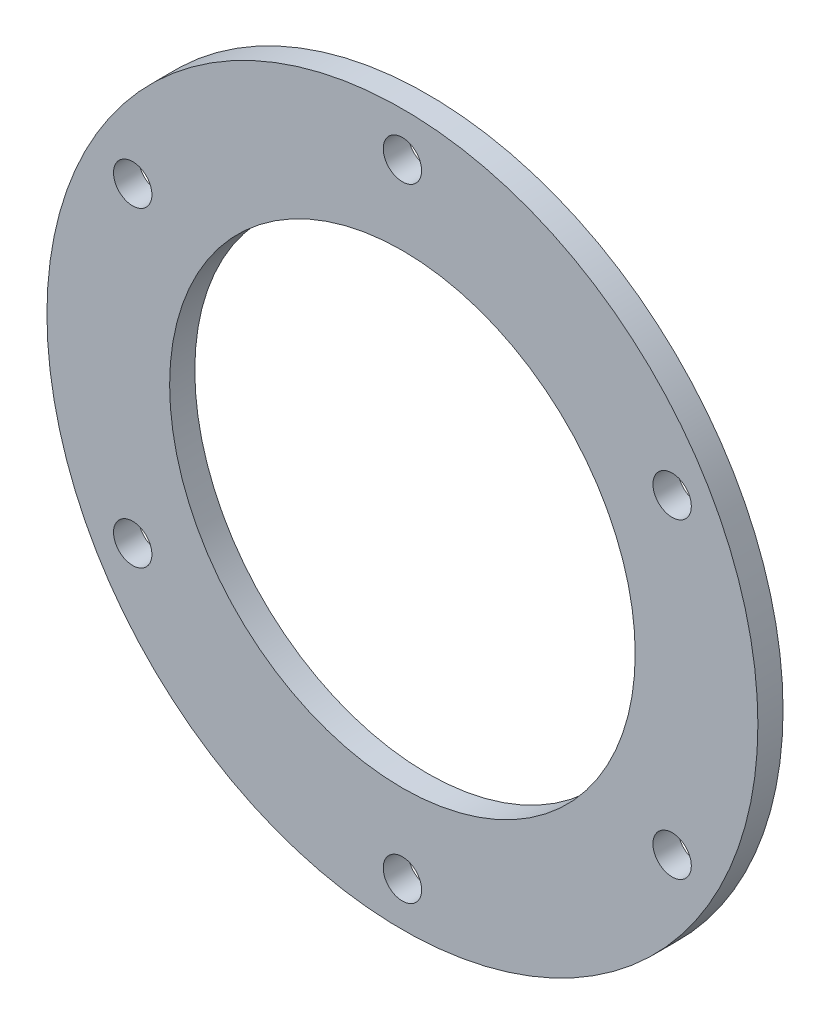
ISO-10303-21;
HEADER;
FILE_DESCRIPTION(('STEP AP214'),'2;1');
FILE_NAME('part.step','',(''),(''),'','','');
FILE_SCHEMA(('AUTOMOTIVE_DESIGN { 1 0 10303 214 1 1 1 1 }'));
ENDSEC;
DATA;
#1=APPLICATION_CONTEXT('core data for automotive mechanical design processes');
#2=APPLICATION_PROTOCOL_DEFINITION('international standard','automotive_design',2000,#1);
#3=PRODUCT_CONTEXT('',#1,'mechanical');
#4=PRODUCT('Part','Part','',(#3));
#5=PRODUCT_RELATED_PRODUCT_CATEGORY('part','',(#4));
#6=PRODUCT_DEFINITION_FORMATION('','',#4);
#7=PRODUCT_DEFINITION_CONTEXT('part definition',#1,'design');
#8=PRODUCT_DEFINITION('design','',#6,#7);
#9=PRODUCT_DEFINITION_SHAPE('','',#8);
#10=(LENGTH_UNIT() NAMED_UNIT(*) SI_UNIT(.MILLI.,.METRE.));
#11=(NAMED_UNIT(*) PLANE_ANGLE_UNIT() SI_UNIT($,.RADIAN.));
#12=(NAMED_UNIT(*) SI_UNIT($,.STERADIAN.) SOLID_ANGLE_UNIT());
#13=UNCERTAINTY_MEASURE_WITH_UNIT(LENGTH_MEASURE(1.E-05),#10,'distance_accuracy_value','');
#14=(GEOMETRIC_REPRESENTATION_CONTEXT(3) GLOBAL_UNCERTAINTY_ASSIGNED_CONTEXT((#13)) GLOBAL_UNIT_ASSIGNED_CONTEXT((#10,
#11,#12)) REPRESENTATION_CONTEXT('',''));
#15=CARTESIAN_POINT('',(0.,0.,0.));
#16=DIRECTION('',(0.,0.,1.));
#17=DIRECTION('',(1.,0.,0.));
#18=AXIS2_PLACEMENT_3D('',#15,#16,#17);
#19=CARTESIAN_POINT('',(0.,0.,2.));
#20=DIRECTION('',(0.,0.,1.));
#21=DIRECTION('',(1.,0.,0.));
#22=AXIS2_PLACEMENT_3D('',#19,#20,#21);
#23=PLANE('',#22);
#24=CARTESIAN_POINT('',(0.,24.75,2.));
#25=DIRECTION('',(0.,0.,1.));
#26=DIRECTION('',(1.,0.,0.));
#27=AXIS2_PLACEMENT_3D('',#24,#25,#26);
#28=CIRCLE('',#27,1.525);
#29=CARTESIAN_POINT('',(1.525,24.75,2.));
#30=VERTEX_POINT('',#29);
#31=EDGE_CURVE('E77',#30,#30,#28,.T.);
#32=ORIENTED_EDGE('',*,*,#31,.F.);
#33=EDGE_LOOP('',(#32));
#34=FACE_BOUND('',#33,.T.);
#35=CARTESIAN_POINT('',(-21.4341287436649,12.375,2.));
#36=DIRECTION('',(0.,0.,1.));
#37=DIRECTION('',(1.,0.,0.));
#38=AXIS2_PLACEMENT_3D('',#35,#36,#37);
#39=CIRCLE('',#38,1.525);
#40=CARTESIAN_POINT('',(-19.9091287436649,12.375,2.));
#41=VERTEX_POINT('',#40);
#42=EDGE_CURVE('E78',#41,#41,#39,.T.);
#43=ORIENTED_EDGE('',*,*,#42,.F.);
#44=EDGE_LOOP('',(#43));
#45=FACE_BOUND('',#44,.T.);
#46=CARTESIAN_POINT('',(-21.4341287436649,-12.375,2.));
#47=DIRECTION('',(0.,0.,1.));
#48=DIRECTION('',(1.,0.,0.));
#49=AXIS2_PLACEMENT_3D('',#46,#47,#48);
#50=CIRCLE('',#49,1.525);
#51=CARTESIAN_POINT('',(-19.9091287436649,-12.375,2.));
#52=VERTEX_POINT('',#51);
#53=EDGE_CURVE('E52',#52,#52,#50,.T.);
#54=ORIENTED_EDGE('',*,*,#53,.F.);
#55=EDGE_LOOP('',(#54));
#56=FACE_BOUND('',#55,.T.);
#57=CARTESIAN_POINT('',(0.,-24.75,2.));
#58=DIRECTION('',(0.,0.,1.));
#59=DIRECTION('',(1.,0.,0.));
#60=AXIS2_PLACEMENT_3D('',#57,#58,#59);
#61=CIRCLE('',#60,1.525);
#62=CARTESIAN_POINT('',(1.525,-24.75,2.));
#63=VERTEX_POINT('',#62);
#64=EDGE_CURVE('E59',#63,#63,#61,.T.);
#65=ORIENTED_EDGE('',*,*,#64,.F.);
#66=EDGE_LOOP('',(#65));
#67=FACE_BOUND('',#66,.T.);
#68=CARTESIAN_POINT('',(21.4341287436649,-12.375,2.));
#69=DIRECTION('',(0.,0.,1.));
#70=DIRECTION('',(1.,0.,0.));
#71=AXIS2_PLACEMENT_3D('',#68,#69,#70);
#72=CIRCLE('',#71,1.525);
#73=CARTESIAN_POINT('',(22.9591287436649,-12.375,2.));
#74=VERTEX_POINT('',#73);
#75=EDGE_CURVE('E65',#74,#74,#72,.T.);
#76=ORIENTED_EDGE('',*,*,#75,.F.);
#77=EDGE_LOOP('',(#76));
#78=FACE_BOUND('',#77,.T.);
#79=CARTESIAN_POINT('',(21.4341287436649,12.375,2.));
#80=DIRECTION('',(0.,0.,1.));
#81=DIRECTION('',(1.,0.,0.));
#82=AXIS2_PLACEMENT_3D('',#79,#80,#81);
#83=CIRCLE('',#82,1.525);
#84=CARTESIAN_POINT('',(22.9591287436649,12.375,2.));
#85=VERTEX_POINT('',#84);
#86=EDGE_CURVE('E71',#85,#85,#83,.T.);
#87=ORIENTED_EDGE('',*,*,#86,.F.);
#88=EDGE_LOOP('',(#87));
#89=FACE_BOUND('',#88,.T.);
#90=CARTESIAN_POINT('',(0.,0.,2.));
#91=DIRECTION('',(0.,0.,1.));
#92=DIRECTION('',(1.,0.,0.));
#93=AXIS2_PLACEMENT_3D('',#90,#91,#92);
#94=CIRCLE('',#93,28.25);
#95=CARTESIAN_POINT('',(28.25,0.,2.));
#96=VERTEX_POINT('',#95);
#97=EDGE_CURVE('E10',#96,#96,#94,.T.);
#98=ORIENTED_EDGE('',*,*,#97,.T.);
#99=EDGE_LOOP('',(#98));
#100=FACE_BOUND('',#99,.T.);
#101=CARTESIAN_POINT('',(0.,0.,2.));
#102=DIRECTION('',(0.,0.,1.));
#103=DIRECTION('',(1.,0.,0.));
#104=AXIS2_PLACEMENT_3D('',#101,#102,#103);
#105=CIRCLE('',#104,18.5);
#106=CARTESIAN_POINT('',(18.5,0.,2.));
#107=VERTEX_POINT('',#106);
#108=EDGE_CURVE('E44',#107,#107,#105,.T.);
#109=ORIENTED_EDGE('',*,*,#108,.F.);
#110=EDGE_LOOP('',(#109));
#111=FACE_BOUND('',#110,.T.);
#112=ADVANCED_FACE('F33',(#34,#45,#56,#67,#78,#89,#100,#111),#23,.T.);
#113=CARTESIAN_POINT('',(0.,0.,0.));
#114=DIRECTION('',(0.,0.,1.));
#115=DIRECTION('',(1.,0.,0.));
#116=AXIS2_PLACEMENT_3D('',#113,#114,#115);
#117=PLANE('',#116);
#118=CARTESIAN_POINT('',(0.,24.75,0.));
#119=DIRECTION('',(0.,0.,1.));
#120=DIRECTION('',(1.,0.,0.));
#121=AXIS2_PLACEMENT_3D('',#118,#119,#120);
#122=CIRCLE('',#121,1.525);
#123=CARTESIAN_POINT('',(1.525,24.75,0.));
#124=VERTEX_POINT('',#123);
#125=EDGE_CURVE('E49',#124,#124,#122,.T.);
#126=ORIENTED_EDGE('',*,*,#125,.T.);
#127=EDGE_LOOP('',(#126));
#128=FACE_BOUND('',#127,.T.);
#129=CARTESIAN_POINT('',(-21.4341287436649,12.375,0.));
#130=DIRECTION('',(0.,0.,1.));
#131=DIRECTION('',(1.,0.,0.));
#132=AXIS2_PLACEMENT_3D('',#129,#130,#131);
#133=CIRCLE('',#132,1.525);
#134=CARTESIAN_POINT('',(-19.9091287436649,12.375,0.));
#135=VERTEX_POINT('',#134);
#136=EDGE_CURVE('E56',#135,#135,#133,.T.);
#137=ORIENTED_EDGE('',*,*,#136,.T.);
#138=EDGE_LOOP('',(#137));
#139=FACE_BOUND('',#138,.T.);
#140=CARTESIAN_POINT('',(-21.4341287436649,-12.375,0.));
#141=DIRECTION('',(0.,0.,1.));
#142=DIRECTION('',(1.,0.,0.));
#143=AXIS2_PLACEMENT_3D('',#140,#141,#142);
#144=CIRCLE('',#143,1.525);
#145=CARTESIAN_POINT('',(-19.9091287436649,-12.375,0.));
#146=VERTEX_POINT('',#145);
#147=EDGE_CURVE('E55',#146,#146,#144,.T.);
#148=ORIENTED_EDGE('',*,*,#147,.T.);
#149=EDGE_LOOP('',(#148));
#150=FACE_BOUND('',#149,.T.);
#151=CARTESIAN_POINT('',(0.,-24.75,0.));
#152=DIRECTION('',(0.,0.,1.));
#153=DIRECTION('',(1.,0.,0.));
#154=AXIS2_PLACEMENT_3D('',#151,#152,#153);
#155=CIRCLE('',#154,1.525);
#156=CARTESIAN_POINT('',(1.525,-24.75,0.));
#157=VERTEX_POINT('',#156);
#158=EDGE_CURVE('E62',#157,#157,#155,.T.);
#159=ORIENTED_EDGE('',*,*,#158,.T.);
#160=EDGE_LOOP('',(#159));
#161=FACE_BOUND('',#160,.T.);
#162=CARTESIAN_POINT('',(21.4341287436649,-12.375,0.));
#163=DIRECTION('',(0.,0.,1.));
#164=DIRECTION('',(1.,0.,0.));
#165=AXIS2_PLACEMENT_3D('',#162,#163,#164);
#166=CIRCLE('',#165,1.525);
#167=CARTESIAN_POINT('',(22.9591287436649,-12.375,0.));
#168=VERTEX_POINT('',#167);
#169=EDGE_CURVE('E68',#168,#168,#166,.T.);
#170=ORIENTED_EDGE('',*,*,#169,.T.);
#171=EDGE_LOOP('',(#170));
#172=FACE_BOUND('',#171,.T.);
#173=CARTESIAN_POINT('',(21.4341287436649,12.375,0.));
#174=DIRECTION('',(0.,0.,1.));
#175=DIRECTION('',(1.,0.,0.));
#176=AXIS2_PLACEMENT_3D('',#173,#174,#175);
#177=CIRCLE('',#176,1.525);
#178=CARTESIAN_POINT('',(22.9591287436649,12.375,0.));
#179=VERTEX_POINT('',#178);
#180=EDGE_CURVE('E74',#179,#179,#177,.T.);
#181=ORIENTED_EDGE('',*,*,#180,.T.);
#182=EDGE_LOOP('',(#181));
#183=FACE_BOUND('',#182,.T.);
#184=CARTESIAN_POINT('',(0.,0.,0.));
#185=DIRECTION('',(0.,0.,1.));
#186=DIRECTION('',(1.,0.,0.));
#187=AXIS2_PLACEMENT_3D('',#184,#185,#186);
#188=CIRCLE('',#187,28.25);
#189=CARTESIAN_POINT('',(28.25,0.,0.));
#190=VERTEX_POINT('',#189);
#191=EDGE_CURVE('E37',#190,#190,#188,.T.);
#192=ORIENTED_EDGE('',*,*,#191,.F.);
#193=EDGE_LOOP('',(#192));
#194=FACE_BOUND('',#193,.T.);
#195=CARTESIAN_POINT('',(0.,0.,0.));
#196=DIRECTION('',(0.,0.,1.));
#197=DIRECTION('',(1.,0.,0.));
#198=AXIS2_PLACEMENT_3D('',#195,#196,#197);
#199=CIRCLE('',#198,18.5);
#200=CARTESIAN_POINT('',(18.5,0.,0.));
#201=VERTEX_POINT('',#200);
#202=EDGE_CURVE('E46',#201,#201,#199,.T.);
#203=ORIENTED_EDGE('',*,*,#202,.T.);
#204=EDGE_LOOP('',(#203));
#205=FACE_BOUND('',#204,.T.);
#206=ADVANCED_FACE('F88',(#128,#139,#150,#161,#172,#183,#194,#205),#117,.F.);
#207=CARTESIAN_POINT('',(0.,0.,2.));
#208=DIRECTION('',(0.,0.,-1.));
#209=DIRECTION('',(-1.,0.,0.));
#210=AXIS2_PLACEMENT_3D('',#207,#208,#209);
#211=CYLINDRICAL_SURFACE('',#210,28.25);
#212=ORIENTED_EDGE('',*,*,#97,.F.);
#213=EDGE_LOOP('',(#212));
#214=FACE_BOUND('',#213,.T.);
#215=ORIENTED_EDGE('',*,*,#191,.T.);
#216=EDGE_LOOP('',(#215));
#217=FACE_BOUND('',#216,.T.);
#218=ADVANCED_FACE('F35',(#214,#217),#211,.T.);
#219=CARTESIAN_POINT('',(0.,0.,2.));
#220=DIRECTION('',(0.,0.,-1.));
#221=DIRECTION('',(-1.,0.,0.));
#222=AXIS2_PLACEMENT_3D('',#219,#220,#221);
#223=CYLINDRICAL_SURFACE('',#222,18.5);
#224=ORIENTED_EDGE('',*,*,#108,.T.);
#225=EDGE_LOOP('',(#224));
#226=FACE_BOUND('',#225,.T.);
#227=ORIENTED_EDGE('',*,*,#202,.F.);
#228=EDGE_LOOP('',(#227));
#229=FACE_BOUND('',#228,.T.);
#230=ADVANCED_FACE('F113',(#226,#229),#223,.F.);
#231=CARTESIAN_POINT('',(21.4341287436649,12.375,0.));
#232=DIRECTION('',(0.,0.,1.));
#233=DIRECTION('',(1.,0.,0.));
#234=AXIS2_PLACEMENT_3D('',#231,#232,#233);
#235=CYLINDRICAL_SURFACE('',#234,1.525);
#236=ORIENTED_EDGE('',*,*,#180,.F.);
#237=EDGE_LOOP('',(#236));
#238=FACE_BOUND('',#237,.T.);
#239=ORIENTED_EDGE('',*,*,#86,.T.);
#240=EDGE_LOOP('',(#239));
#241=FACE_BOUND('',#240,.T.);
#242=ADVANCED_FACE('F116',(#238,#241),#235,.F.);
#243=CARTESIAN_POINT('',(21.4341287436649,-12.375,0.));
#244=DIRECTION('',(0.,0.,1.));
#245=DIRECTION('',(1.,0.,0.));
#246=AXIS2_PLACEMENT_3D('',#243,#244,#245);
#247=CYLINDRICAL_SURFACE('',#246,1.525);
#248=ORIENTED_EDGE('',*,*,#169,.F.);
#249=EDGE_LOOP('',(#248));
#250=FACE_BOUND('',#249,.T.);
#251=ORIENTED_EDGE('',*,*,#75,.T.);
#252=EDGE_LOOP('',(#251));
#253=FACE_BOUND('',#252,.T.);
#254=ADVANCED_FACE('F133',(#250,#253),#247,.F.);
#255=CARTESIAN_POINT('',(0.,-24.75,0.));
#256=DIRECTION('',(0.,0.,1.));
#257=DIRECTION('',(1.,0.,0.));
#258=AXIS2_PLACEMENT_3D('',#255,#256,#257);
#259=CYLINDRICAL_SURFACE('',#258,1.525);
#260=ORIENTED_EDGE('',*,*,#158,.F.);
#261=EDGE_LOOP('',(#260));
#262=FACE_BOUND('',#261,.T.);
#263=ORIENTED_EDGE('',*,*,#64,.T.);
#264=EDGE_LOOP('',(#263));
#265=FACE_BOUND('',#264,.T.);
#266=ADVANCED_FACE('F129',(#262,#265),#259,.F.);
#267=CARTESIAN_POINT('',(-21.4341287436649,-12.375,0.));
#268=DIRECTION('',(0.,0.,1.));
#269=DIRECTION('',(1.,0.,0.));
#270=AXIS2_PLACEMENT_3D('',#267,#268,#269);
#271=CYLINDRICAL_SURFACE('',#270,1.525);
#272=ORIENTED_EDGE('',*,*,#147,.F.);
#273=EDGE_LOOP('',(#272));
#274=FACE_BOUND('',#273,.T.);
#275=ORIENTED_EDGE('',*,*,#53,.T.);
#276=EDGE_LOOP('',(#275));
#277=FACE_BOUND('',#276,.T.);
#278=ADVANCED_FACE('F126',(#274,#277),#271,.F.);
#279=CARTESIAN_POINT('',(-21.4341287436649,12.375,0.));
#280=DIRECTION('',(0.,0.,1.));
#281=DIRECTION('',(1.,0.,0.));
#282=AXIS2_PLACEMENT_3D('',#279,#280,#281);
#283=CYLINDRICAL_SURFACE('',#282,1.525);
#284=ORIENTED_EDGE('',*,*,#136,.F.);
#285=EDGE_LOOP('',(#284));
#286=FACE_BOUND('',#285,.T.);
#287=ORIENTED_EDGE('',*,*,#42,.T.);
#288=EDGE_LOOP('',(#287));
#289=FACE_BOUND('',#288,.T.);
#290=ADVANCED_FACE('F94',(#286,#289),#283,.F.);
#291=CARTESIAN_POINT('',(0.,24.75,0.));
#292=DIRECTION('',(0.,0.,1.));
#293=DIRECTION('',(1.,0.,0.));
#294=AXIS2_PLACEMENT_3D('',#291,#292,#293);
#295=CYLINDRICAL_SURFACE('',#294,1.525);
#296=ORIENTED_EDGE('',*,*,#125,.F.);
#297=EDGE_LOOP('',(#296));
#298=FACE_BOUND('',#297,.T.);
#299=ORIENTED_EDGE('',*,*,#31,.T.);
#300=EDGE_LOOP('',(#299));
#301=FACE_BOUND('',#300,.T.);
#302=ADVANCED_FACE('F91',(#298,#301),#295,.F.);
#303=CLOSED_SHELL('',(#112,#206,#218,#230,#242,#254,#266,#278,#290,#302));
#304=MANIFOLD_SOLID_BREP('B2',#303);
#305=ADVANCED_BREP_SHAPE_REPRESENTATION('',(#18,#304),#14);
#306=SHAPE_DEFINITION_REPRESENTATION(#9,#305);
ENDSEC;
END-ISO-10303-21;
